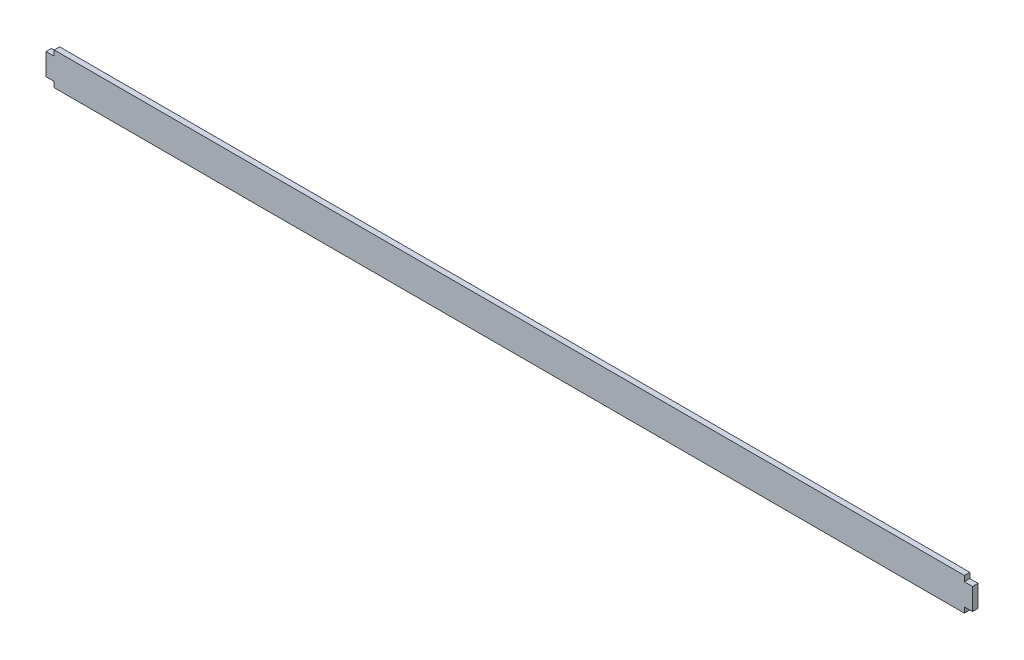
ISO-10303-21;
HEADER;
FILE_DESCRIPTION(('STEP AP214'),'2;1');
FILE_NAME('part.step','',(''),(''),'','','');
FILE_SCHEMA(('AUTOMOTIVE_DESIGN { 1 0 10303 214 1 1 1 1 }'));
ENDSEC;
DATA;
#1=APPLICATION_CONTEXT('core data for automotive mechanical design processes');
#2=APPLICATION_PROTOCOL_DEFINITION('international standard','automotive_design',2000,#1);
#3=PRODUCT_CONTEXT('',#1,'mechanical');
#4=PRODUCT('Part','Part','',(#3));
#5=PRODUCT_RELATED_PRODUCT_CATEGORY('part','',(#4));
#6=PRODUCT_DEFINITION_FORMATION('','',#4);
#7=PRODUCT_DEFINITION_CONTEXT('part definition',#1,'design');
#8=PRODUCT_DEFINITION('design','',#6,#7);
#9=PRODUCT_DEFINITION_SHAPE('','',#8);
#10=(LENGTH_UNIT() NAMED_UNIT(*) SI_UNIT(.MILLI.,.METRE.));
#11=(NAMED_UNIT(*) PLANE_ANGLE_UNIT() SI_UNIT($,.RADIAN.));
#12=(NAMED_UNIT(*) SI_UNIT($,.STERADIAN.) SOLID_ANGLE_UNIT());
#13=UNCERTAINTY_MEASURE_WITH_UNIT(LENGTH_MEASURE(1.E-05),#10,'distance_accuracy_value','');
#14=(GEOMETRIC_REPRESENTATION_CONTEXT(3) GLOBAL_UNCERTAINTY_ASSIGNED_CONTEXT((#13)) GLOBAL_UNIT_ASSIGNED_CONTEXT((#10,
#11,#12)) REPRESENTATION_CONTEXT('',''));
#15=CARTESIAN_POINT('',(0.,0.,0.));
#16=DIRECTION('',(0.,0.,1.));
#17=DIRECTION('',(1.,0.,0.));
#18=AXIS2_PLACEMENT_3D('',#15,#16,#17);
#19=CARTESIAN_POINT('',(0.,0.,3.175));
#20=DIRECTION('',(1.,0.,0.));
#21=DIRECTION('',(0.,1.,0.));
#22=AXIS2_PLACEMENT_3D('',#19,#20,#21);
#23=PLANE('',#22);
#24=DIRECTION('',(0.,-1.,0.));
#25=VECTOR('',#24,1.);
#26=CARTESIAN_POINT('',(0.,0.,0.));
#27=LINE('',#26,#25);
#28=CARTESIAN_POINT('',(0.,3.175,0.));
#29=VERTEX_POINT('',#28);
#30=CARTESIAN_POINT('',(0.,0.,0.));
#31=VERTEX_POINT('',#30);
#32=EDGE_CURVE('E154',#29,#31,#27,.T.);
#33=ORIENTED_EDGE('',*,*,#32,.T.);
#34=DIRECTION('',(0.,0.,-1.));
#35=VECTOR('',#34,1.);
#36=CARTESIAN_POINT('',(0.,0.,3.175));
#37=LINE('',#36,#35);
#38=CARTESIAN_POINT('',(0.,0.,3.175));
#39=VERTEX_POINT('',#38);
#40=EDGE_CURVE('E11',#39,#31,#37,.T.);
#41=ORIENTED_EDGE('',*,*,#40,.F.);
#42=DIRECTION('',(0.,-1.,0.));
#43=VECTOR('',#42,1.);
#44=CARTESIAN_POINT('',(0.,0.,3.175));
#45=LINE('',#44,#43);
#46=CARTESIAN_POINT('',(0.,3.175,3.175));
#47=VERTEX_POINT('',#46);
#48=EDGE_CURVE('E176',#47,#39,#45,.T.);
#49=ORIENTED_EDGE('',*,*,#48,.F.);
#50=DIRECTION('',(0.,0.,-1.));
#51=VECTOR('',#50,1.);
#52=CARTESIAN_POINT('',(0.,3.175,3.175));
#53=LINE('',#52,#51);
#54=EDGE_CURVE('E150',#47,#29,#53,.T.);
#55=ORIENTED_EDGE('',*,*,#54,.T.);
#56=EDGE_LOOP('',(#33,#41,#49,#55));
#57=FACE_BOUND('',#56,.T.);
#58=ADVANCED_FACE('F34',(#57),#23,.F.);
#59=CARTESIAN_POINT('',(0.,0.,3.175));
#60=DIRECTION('',(0.,1.,0.));
#61=DIRECTION('',(0.,0.,1.));
#62=AXIS2_PLACEMENT_3D('',#59,#60,#61);
#63=PLANE('',#62);
#64=DIRECTION('',(1.,0.,0.));
#65=VECTOR('',#64,1.);
#66=CARTESIAN_POINT('',(0.,0.,0.));
#67=LINE('',#66,#65);
#68=CARTESIAN_POINT('',(530.225,0.,0.));
#69=VERTEX_POINT('',#68);
#70=EDGE_CURVE('E157',#31,#69,#67,.T.);
#71=ORIENTED_EDGE('',*,*,#70,.T.);
#72=DIRECTION('',(0.,0.,-1.));
#73=VECTOR('',#72,1.);
#74=CARTESIAN_POINT('',(530.225,0.,3.175));
#75=LINE('',#74,#73);
#76=CARTESIAN_POINT('',(530.225,0.,3.175));
#77=VERTEX_POINT('',#76);
#78=EDGE_CURVE('E42',#77,#69,#75,.T.);
#79=ORIENTED_EDGE('',*,*,#78,.F.);
#80=DIRECTION('',(1.,0.,0.));
#81=VECTOR('',#80,1.);
#82=CARTESIAN_POINT('',(0.,0.,3.175));
#83=LINE('',#82,#81);
#84=EDGE_CURVE('E105',#39,#77,#83,.T.);
#85=ORIENTED_EDGE('',*,*,#84,.F.);
#86=ORIENTED_EDGE('',*,*,#40,.T.);
#87=EDGE_LOOP('',(#71,#79,#85,#86));
#88=FACE_BOUND('',#87,.T.);
#89=ADVANCED_FACE('F254',(#88),#63,.F.);
#90=CARTESIAN_POINT('',(530.225,0.,3.175));
#91=DIRECTION('',(-1.,0.,0.));
#92=DIRECTION('',(0.,0.,1.));
#93=AXIS2_PLACEMENT_3D('',#90,#91,#92);
#94=PLANE('',#93);
#95=DIRECTION('',(0.,1.,0.));
#96=VECTOR('',#95,1.);
#97=CARTESIAN_POINT('',(530.225,0.,0.));
#98=LINE('',#97,#96);
#99=CARTESIAN_POINT('',(530.225,3.175,0.));
#100=VERTEX_POINT('',#99);
#101=EDGE_CURVE('E159',#69,#100,#98,.T.);
#102=ORIENTED_EDGE('',*,*,#101,.T.);
#103=DIRECTION('',(0.,0.,-1.));
#104=VECTOR('',#103,1.);
#105=CARTESIAN_POINT('',(530.225,3.175,3.175));
#106=LINE('',#105,#104);
#107=CARTESIAN_POINT('',(530.225,3.175,3.175));
#108=VERTEX_POINT('',#107);
#109=EDGE_CURVE('E195',#108,#100,#106,.T.);
#110=ORIENTED_EDGE('',*,*,#109,.F.);
#111=DIRECTION('',(0.,1.,0.));
#112=VECTOR('',#111,1.);
#113=CARTESIAN_POINT('',(530.225,0.,3.175));
#114=LINE('',#113,#112);
#115=EDGE_CURVE('E203',#77,#108,#114,.T.);
#116=ORIENTED_EDGE('',*,*,#115,.F.);
#117=ORIENTED_EDGE('',*,*,#78,.T.);
#118=EDGE_LOOP('',(#102,#110,#116,#117));
#119=FACE_BOUND('',#118,.T.);
#120=ADVANCED_FACE('F201',(#119),#94,.F.);
#121=CARTESIAN_POINT('',(530.225,3.175,3.175));
#122=DIRECTION('',(0.,1.,0.));
#123=DIRECTION('',(0.,0.,1.));
#124=AXIS2_PLACEMENT_3D('',#121,#122,#123);
#125=PLANE('',#124);
#126=DIRECTION('',(1.,0.,0.));
#127=VECTOR('',#126,1.);
#128=CARTESIAN_POINT('',(530.225,3.175,0.));
#129=LINE('',#128,#127);
#130=CARTESIAN_POINT('',(534.9875,3.175,0.));
#131=VERTEX_POINT('',#130);
#132=EDGE_CURVE('E161',#100,#131,#129,.T.);
#133=ORIENTED_EDGE('',*,*,#132,.T.);
#134=DIRECTION('',(0.,0.,-1.));
#135=VECTOR('',#134,1.);
#136=CARTESIAN_POINT('',(534.9875,3.175,3.175));
#137=LINE('',#136,#135);
#138=CARTESIAN_POINT('',(534.9875,3.175,3.175));
#139=VERTEX_POINT('',#138);
#140=EDGE_CURVE('E192',#139,#131,#137,.T.);
#141=ORIENTED_EDGE('',*,*,#140,.F.);
#142=DIRECTION('',(1.,0.,0.));
#143=VECTOR('',#142,1.);
#144=CARTESIAN_POINT('',(530.225,3.175,3.175));
#145=LINE('',#144,#143);
#146=EDGE_CURVE('E221',#108,#139,#145,.T.);
#147=ORIENTED_EDGE('',*,*,#146,.F.);
#148=ORIENTED_EDGE('',*,*,#109,.T.);
#149=EDGE_LOOP('',(#133,#141,#147,#148));
#150=FACE_BOUND('',#149,.T.);
#151=ADVANCED_FACE('F212',(#150),#125,.F.);
#152=CARTESIAN_POINT('',(534.9875,3.175,3.175));
#153=DIRECTION('',(-1.,0.,0.));
#154=DIRECTION('',(0.,0.,1.));
#155=AXIS2_PLACEMENT_3D('',#152,#153,#154);
#156=PLANE('',#155);
#157=DIRECTION('',(0.,1.,0.));
#158=VECTOR('',#157,1.);
#159=CARTESIAN_POINT('',(534.9875,3.175,0.));
#160=LINE('',#159,#158);
#161=CARTESIAN_POINT('',(534.9875,15.875,0.));
#162=VERTEX_POINT('',#161);
#163=EDGE_CURVE('E163',#131,#162,#160,.T.);
#164=ORIENTED_EDGE('',*,*,#163,.T.);
#165=DIRECTION('',(0.,0.,-1.));
#166=VECTOR('',#165,1.);
#167=CARTESIAN_POINT('',(534.9875,15.875,3.175));
#168=LINE('',#167,#166);
#169=CARTESIAN_POINT('',(534.9875,15.875,3.175));
#170=VERTEX_POINT('',#169);
#171=EDGE_CURVE('E189',#170,#162,#168,.T.);
#172=ORIENTED_EDGE('',*,*,#171,.F.);
#173=DIRECTION('',(0.,1.,0.));
#174=VECTOR('',#173,1.);
#175=CARTESIAN_POINT('',(534.9875,3.175,3.175));
#176=LINE('',#175,#174);
#177=EDGE_CURVE('E218',#139,#170,#176,.T.);
#178=ORIENTED_EDGE('',*,*,#177,.F.);
#179=ORIENTED_EDGE('',*,*,#140,.T.);
#180=EDGE_LOOP('',(#164,#172,#178,#179));
#181=FACE_BOUND('',#180,.T.);
#182=ADVANCED_FACE('F216',(#181),#156,.F.);
#183=CARTESIAN_POINT('',(530.225,15.875,3.175));
#184=DIRECTION('',(0.,-1.,0.));
#185=DIRECTION('',(0.,0.,-1.));
#186=AXIS2_PLACEMENT_3D('',#183,#184,#185);
#187=PLANE('',#186);
#188=DIRECTION('',(-1.,0.,0.));
#189=VECTOR('',#188,1.);
#190=CARTESIAN_POINT('',(530.225,15.875,0.));
#191=LINE('',#190,#189);
#192=CARTESIAN_POINT('',(530.225,15.875,0.));
#193=VERTEX_POINT('',#192);
#194=EDGE_CURVE('E165',#162,#193,#191,.T.);
#195=ORIENTED_EDGE('',*,*,#194,.T.);
#196=DIRECTION('',(0.,0.,-1.));
#197=VECTOR('',#196,1.);
#198=CARTESIAN_POINT('',(530.225,15.875,3.175));
#199=LINE('',#198,#197);
#200=CARTESIAN_POINT('',(530.225,15.875,3.175));
#201=VERTEX_POINT('',#200);
#202=EDGE_CURVE('E186',#201,#193,#199,.T.);
#203=ORIENTED_EDGE('',*,*,#202,.F.);
#204=DIRECTION('',(-1.,0.,0.));
#205=VECTOR('',#204,1.);
#206=CARTESIAN_POINT('',(530.225,15.875,3.175));
#207=LINE('',#206,#205);
#208=EDGE_CURVE('E220',#170,#201,#207,.T.);
#209=ORIENTED_EDGE('',*,*,#208,.F.);
#210=ORIENTED_EDGE('',*,*,#171,.T.);
#211=EDGE_LOOP('',(#195,#203,#209,#210));
#212=FACE_BOUND('',#211,.T.);
#213=ADVANCED_FACE('F267',(#212),#187,.F.);
#214=CARTESIAN_POINT('',(530.225,15.875,3.175));
#215=DIRECTION('',(-1.,0.,0.));
#216=DIRECTION('',(0.,0.,1.));
#217=AXIS2_PLACEMENT_3D('',#214,#215,#216);
#218=PLANE('',#217);
#219=DIRECTION('',(0.,1.,0.));
#220=VECTOR('',#219,1.);
#221=CARTESIAN_POINT('',(530.225,15.875,0.));
#222=LINE('',#221,#220);
#223=CARTESIAN_POINT('',(530.225,19.05,0.));
#224=VERTEX_POINT('',#223);
#225=EDGE_CURVE('E167',#193,#224,#222,.T.);
#226=ORIENTED_EDGE('',*,*,#225,.T.);
#227=DIRECTION('',(0.,0.,-1.));
#228=VECTOR('',#227,1.);
#229=CARTESIAN_POINT('',(530.225,19.05,3.175));
#230=LINE('',#229,#228);
#231=CARTESIAN_POINT('',(530.225,19.05,3.175));
#232=VERTEX_POINT('',#231);
#233=EDGE_CURVE('E183',#232,#224,#230,.T.);
#234=ORIENTED_EDGE('',*,*,#233,.F.);
#235=DIRECTION('',(0.,1.,0.));
#236=VECTOR('',#235,1.);
#237=CARTESIAN_POINT('',(530.225,15.875,3.175));
#238=LINE('',#237,#236);
#239=EDGE_CURVE('E223',#201,#232,#238,.T.);
#240=ORIENTED_EDGE('',*,*,#239,.F.);
#241=ORIENTED_EDGE('',*,*,#202,.T.);
#242=EDGE_LOOP('',(#226,#234,#240,#241));
#243=FACE_BOUND('',#242,.T.);
#244=ADVANCED_FACE('F270',(#243),#218,.F.);
#245=CARTESIAN_POINT('',(0.,19.05,3.175));
#246=DIRECTION('',(0.,-1.,0.));
#247=DIRECTION('',(0.,0.,-1.));
#248=AXIS2_PLACEMENT_3D('',#245,#246,#247);
#249=PLANE('',#248);
#250=DIRECTION('',(-1.,0.,0.));
#251=VECTOR('',#250,1.);
#252=CARTESIAN_POINT('',(0.,19.05,0.));
#253=LINE('',#252,#251);
#254=CARTESIAN_POINT('',(0.,19.05,0.));
#255=VERTEX_POINT('',#254);
#256=EDGE_CURVE('E169',#224,#255,#253,.T.);
#257=ORIENTED_EDGE('',*,*,#256,.T.);
#258=DIRECTION('',(0.,0.,-1.));
#259=VECTOR('',#258,1.);
#260=CARTESIAN_POINT('',(0.,19.05,3.175));
#261=LINE('',#260,#259);
#262=CARTESIAN_POINT('',(0.,19.05,3.175));
#263=VERTEX_POINT('',#262);
#264=EDGE_CURVE('E180',#263,#255,#261,.T.);
#265=ORIENTED_EDGE('',*,*,#264,.F.);
#266=DIRECTION('',(-1.,0.,0.));
#267=VECTOR('',#266,1.);
#268=CARTESIAN_POINT('',(0.,19.05,3.175));
#269=LINE('',#268,#267);
#270=EDGE_CURVE('E229',#232,#263,#269,.T.);
#271=ORIENTED_EDGE('',*,*,#270,.F.);
#272=ORIENTED_EDGE('',*,*,#233,.T.);
#273=EDGE_LOOP('',(#257,#265,#271,#272));
#274=FACE_BOUND('',#273,.T.);
#275=ADVANCED_FACE('F235',(#274),#249,.F.);
#276=CARTESIAN_POINT('',(0.,15.875,3.175));
#277=DIRECTION('',(1.,0.,0.));
#278=DIRECTION('',(0.,0.,-1.));
#279=AXIS2_PLACEMENT_3D('',#276,#277,#278);
#280=PLANE('',#279);
#281=DIRECTION('',(0.,-1.,0.));
#282=VECTOR('',#281,1.);
#283=CARTESIAN_POINT('',(0.,15.875,0.));
#284=LINE('',#283,#282);
#285=CARTESIAN_POINT('',(0.,15.875,0.));
#286=VERTEX_POINT('',#285);
#287=EDGE_CURVE('E171',#255,#286,#284,.T.);
#288=ORIENTED_EDGE('',*,*,#287,.T.);
#289=DIRECTION('',(0.,0.,-1.));
#290=VECTOR('',#289,1.);
#291=CARTESIAN_POINT('',(0.,15.875,3.175));
#292=LINE('',#291,#290);
#293=CARTESIAN_POINT('',(0.,15.875,3.175));
#294=VERTEX_POINT('',#293);
#295=EDGE_CURVE('E145',#294,#286,#292,.T.);
#296=ORIENTED_EDGE('',*,*,#295,.F.);
#297=DIRECTION('',(0.,-1.,0.));
#298=VECTOR('',#297,1.);
#299=CARTESIAN_POINT('',(0.,15.875,3.175));
#300=LINE('',#299,#298);
#301=EDGE_CURVE('E136',#263,#294,#300,.T.);
#302=ORIENTED_EDGE('',*,*,#301,.F.);
#303=ORIENTED_EDGE('',*,*,#264,.T.);
#304=EDGE_LOOP('',(#288,#296,#302,#303));
#305=FACE_BOUND('',#304,.T.);
#306=ADVANCED_FACE('F239',(#305),#280,.F.);
#307=CARTESIAN_POINT('',(0.,15.875,3.175));
#308=DIRECTION('',(0.,-1.,0.));
#309=DIRECTION('',(1.,0.,0.));
#310=AXIS2_PLACEMENT_3D('',#307,#308,#309);
#311=PLANE('',#310);
#312=DIRECTION('',(-1.,0.,0.));
#313=VECTOR('',#312,1.);
#314=CARTESIAN_POINT('',(0.,15.875,0.));
#315=LINE('',#314,#313);
#316=CARTESIAN_POINT('',(-4.7625,15.875,0.));
#317=VERTEX_POINT('',#316);
#318=EDGE_CURVE('E144',#286,#317,#315,.T.);
#319=ORIENTED_EDGE('',*,*,#318,.T.);
#320=DIRECTION('',(0.,0.,-1.));
#321=VECTOR('',#320,1.);
#322=CARTESIAN_POINT('',(-4.7625,15.875,3.175));
#323=LINE('',#322,#321);
#324=CARTESIAN_POINT('',(-4.7625,15.875,3.175));
#325=VERTEX_POINT('',#324);
#326=EDGE_CURVE('E141',#325,#317,#323,.T.);
#327=ORIENTED_EDGE('',*,*,#326,.F.);
#328=DIRECTION('',(-1.,0.,0.));
#329=VECTOR('',#328,1.);
#330=CARTESIAN_POINT('',(0.,15.875,3.175));
#331=LINE('',#330,#329);
#332=EDGE_CURVE('E130',#294,#325,#331,.T.);
#333=ORIENTED_EDGE('',*,*,#332,.F.);
#334=ORIENTED_EDGE('',*,*,#295,.T.);
#335=EDGE_LOOP('',(#319,#327,#333,#334));
#336=FACE_BOUND('',#335,.T.);
#337=ADVANCED_FACE('F142',(#336),#311,.F.);
#338=CARTESIAN_POINT('',(-4.7625,3.175,3.175));
#339=DIRECTION('',(1.,0.,0.));
#340=DIRECTION('',(0.,1.,0.));
#341=AXIS2_PLACEMENT_3D('',#338,#339,#340);
#342=PLANE('',#341);
#343=DIRECTION('',(0.,-1.,0.));
#344=VECTOR('',#343,1.);
#345=CARTESIAN_POINT('',(-4.7625,3.175,0.));
#346=LINE('',#345,#344);
#347=CARTESIAN_POINT('',(-4.7625,3.175,0.));
#348=VERTEX_POINT('',#347);
#349=EDGE_CURVE('E91',#317,#348,#346,.T.);
#350=ORIENTED_EDGE('',*,*,#349,.T.);
#351=DIRECTION('',(0.,0.,-1.));
#352=VECTOR('',#351,1.);
#353=CARTESIAN_POINT('',(-4.7625,3.175,3.175));
#354=LINE('',#353,#352);
#355=CARTESIAN_POINT('',(-4.7625,3.175,3.175));
#356=VERTEX_POINT('',#355);
#357=EDGE_CURVE('E146',#356,#348,#354,.T.);
#358=ORIENTED_EDGE('',*,*,#357,.F.);
#359=DIRECTION('',(0.,-1.,0.));
#360=VECTOR('',#359,1.);
#361=CARTESIAN_POINT('',(-4.7625,3.175,3.175));
#362=LINE('',#361,#360);
#363=EDGE_CURVE('E134',#325,#356,#362,.T.);
#364=ORIENTED_EDGE('',*,*,#363,.F.);
#365=ORIENTED_EDGE('',*,*,#326,.T.);
#366=EDGE_LOOP('',(#350,#358,#364,#365));
#367=FACE_BOUND('',#366,.T.);
#368=ADVANCED_FACE('F148',(#367),#342,.F.);
#369=CARTESIAN_POINT('',(0.,3.175,3.175));
#370=DIRECTION('',(0.,1.,0.));
#371=DIRECTION('',(-1.,0.,0.));
#372=AXIS2_PLACEMENT_3D('',#369,#370,#371);
#373=PLANE('',#372);
#374=DIRECTION('',(1.,0.,0.));
#375=VECTOR('',#374,1.);
#376=CARTESIAN_POINT('',(0.,3.175,0.));
#377=LINE('',#376,#375);
#378=EDGE_CURVE('E97',#348,#29,#377,.T.);
#379=ORIENTED_EDGE('',*,*,#378,.T.);
#380=ORIENTED_EDGE('',*,*,#54,.F.);
#381=DIRECTION('',(1.,0.,0.));
#382=VECTOR('',#381,1.);
#383=CARTESIAN_POINT('',(0.,3.175,3.175));
#384=LINE('',#383,#382);
#385=EDGE_CURVE('E50',#356,#47,#384,.T.);
#386=ORIENTED_EDGE('',*,*,#385,.F.);
#387=ORIENTED_EDGE('',*,*,#357,.T.);
#388=EDGE_LOOP('',(#379,#380,#386,#387));
#389=FACE_BOUND('',#388,.T.);
#390=ADVANCED_FACE('F243',(#389),#373,.F.);
#391=CARTESIAN_POINT('',(0.,0.,3.175));
#392=DIRECTION('',(0.,0.,1.));
#393=DIRECTION('',(1.,0.,0.));
#394=AXIS2_PLACEMENT_3D('',#391,#392,#393);
#395=PLANE('',#394);
#396=ORIENTED_EDGE('',*,*,#48,.T.);
#397=ORIENTED_EDGE('',*,*,#84,.T.);
#398=ORIENTED_EDGE('',*,*,#115,.T.);
#399=ORIENTED_EDGE('',*,*,#146,.T.);
#400=ORIENTED_EDGE('',*,*,#177,.T.);
#401=ORIENTED_EDGE('',*,*,#208,.T.);
#402=ORIENTED_EDGE('',*,*,#239,.T.);
#403=ORIENTED_EDGE('',*,*,#270,.T.);
#404=ORIENTED_EDGE('',*,*,#301,.T.);
#405=ORIENTED_EDGE('',*,*,#332,.T.);
#406=ORIENTED_EDGE('',*,*,#363,.T.);
#407=ORIENTED_EDGE('',*,*,#385,.T.);
#408=EDGE_LOOP('',(#396,#397,#398,#399,#400,#401,#402,#403,#404,#405,#406,#407));
#409=FACE_BOUND('',#408,.T.);
#410=ADVANCED_FACE('F132',(#409),#395,.T.);
#411=CARTESIAN_POINT('',(0.,0.,0.));
#412=DIRECTION('',(0.,0.,1.));
#413=DIRECTION('',(1.,0.,0.));
#414=AXIS2_PLACEMENT_3D('',#411,#412,#413);
#415=PLANE('',#414);
#416=ORIENTED_EDGE('',*,*,#32,.F.);
#417=ORIENTED_EDGE('',*,*,#378,.F.);
#418=ORIENTED_EDGE('',*,*,#349,.F.);
#419=ORIENTED_EDGE('',*,*,#318,.F.);
#420=ORIENTED_EDGE('',*,*,#287,.F.);
#421=ORIENTED_EDGE('',*,*,#256,.F.);
#422=ORIENTED_EDGE('',*,*,#225,.F.);
#423=ORIENTED_EDGE('',*,*,#194,.F.);
#424=ORIENTED_EDGE('',*,*,#163,.F.);
#425=ORIENTED_EDGE('',*,*,#132,.F.);
#426=ORIENTED_EDGE('',*,*,#101,.F.);
#427=ORIENTED_EDGE('',*,*,#70,.F.);
#428=EDGE_LOOP('',(#416,#417,#418,#419,#420,#421,#422,#423,#424,#425,#426,#427));
#429=FACE_BOUND('',#428,.T.);
#430=ADVANCED_FACE('F207',(#429),#415,.F.);
#431=CLOSED_SHELL('',(#58,#89,#120,#151,#182,#213,#244,#275,#306,#337,#368,#390,#410,#430));
#432=MANIFOLD_SOLID_BREP('B2',#431);
#433=ADVANCED_BREP_SHAPE_REPRESENTATION('',(#18,#432),#14);
#434=SHAPE_DEFINITION_REPRESENTATION(#9,#433);
ENDSEC;
END-ISO-10303-21;
